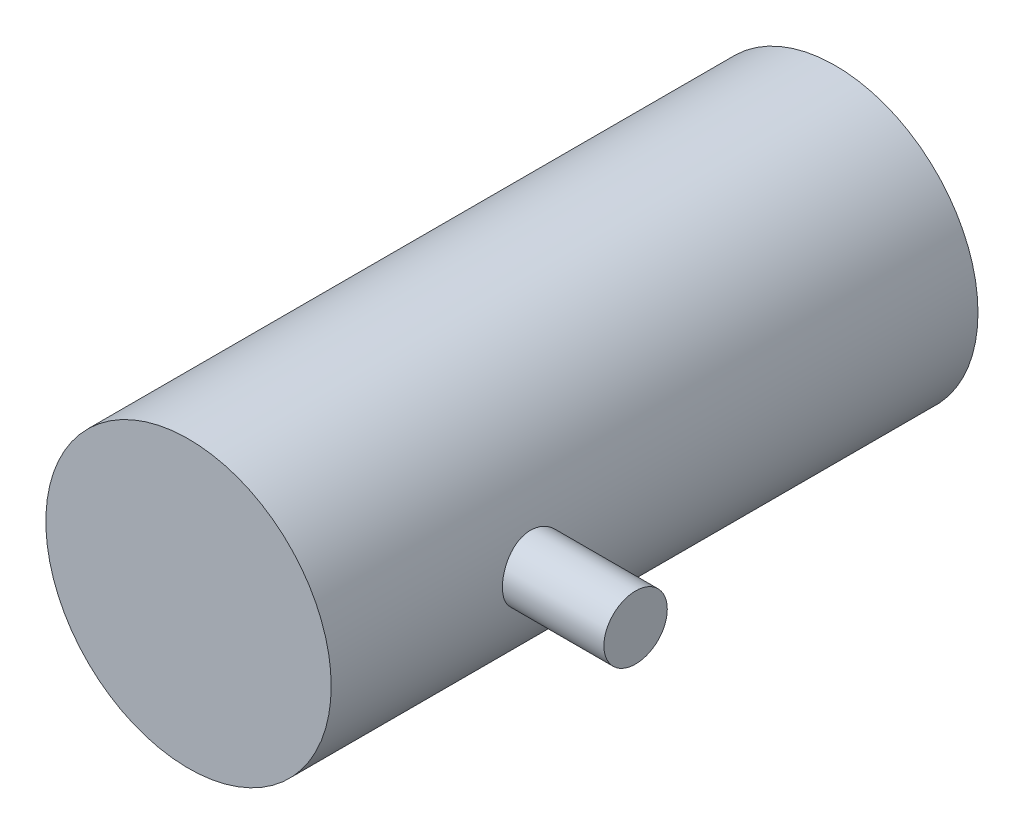
ISO-10303-21;
HEADER;
FILE_DESCRIPTION(('STEP AP214'),'2;1');
FILE_NAME('part.step','',(''),(''),'','','');
FILE_SCHEMA(('AUTOMOTIVE_DESIGN { 1 0 10303 214 1 1 1 1 }'));
ENDSEC;
DATA;
#1=APPLICATION_CONTEXT('core data for automotive mechanical design processes');
#2=APPLICATION_PROTOCOL_DEFINITION('international standard','automotive_design',2000,#1);
#3=PRODUCT_CONTEXT('',#1,'mechanical');
#4=PRODUCT('Part','Part','',(#3));
#5=PRODUCT_RELATED_PRODUCT_CATEGORY('part','',(#4));
#6=PRODUCT_DEFINITION_FORMATION('','',#4);
#7=PRODUCT_DEFINITION_CONTEXT('part definition',#1,'design');
#8=PRODUCT_DEFINITION('design','',#6,#7);
#9=PRODUCT_DEFINITION_SHAPE('','',#8);
#10=(LENGTH_UNIT() NAMED_UNIT(*) SI_UNIT(.MILLI.,.METRE.));
#11=(NAMED_UNIT(*) PLANE_ANGLE_UNIT() SI_UNIT($,.RADIAN.));
#12=(NAMED_UNIT(*) SI_UNIT($,.STERADIAN.) SOLID_ANGLE_UNIT());
#13=UNCERTAINTY_MEASURE_WITH_UNIT(LENGTH_MEASURE(1.E-05),#10,'distance_accuracy_value','');
#14=(GEOMETRIC_REPRESENTATION_CONTEXT(3) GLOBAL_UNCERTAINTY_ASSIGNED_CONTEXT((#13)) GLOBAL_UNIT_ASSIGNED_CONTEXT((#10,
#11,#12)) REPRESENTATION_CONTEXT('',''));
#15=CARTESIAN_POINT('',(0.,0.,0.));
#16=DIRECTION('',(0.,0.,1.));
#17=DIRECTION('',(1.,0.,0.));
#18=AXIS2_PLACEMENT_3D('',#15,#16,#17);
#19=CARTESIAN_POINT('',(0.,0.,1020.));
#20=DIRECTION('',(0.,0.,-1.));
#21=DIRECTION('',(-1.,0.,0.));
#22=AXIS2_PLACEMENT_3D('',#19,#20,#21);
#23=CYLINDRICAL_SURFACE('',#22,225.);
#24=CARTESIAN_POINT('',(0.,0.,1020.));
#25=DIRECTION('',(0.,0.,1.));
#26=DIRECTION('',(1.,0.,0.));
#27=AXIS2_PLACEMENT_3D('',#24,#25,#26);
#28=CIRCLE('',#27,225.);
#29=CARTESIAN_POINT('',(225.,0.,1020.));
#30=VERTEX_POINT('',#29);
#31=EDGE_CURVE('E53',#30,#30,#28,.T.);
#32=ORIENTED_EDGE('',*,*,#31,.F.);
#33=EDGE_LOOP('',(#32));
#34=FACE_BOUND('',#33,.T.);
#35=CARTESIAN_POINT('',(0.,0.,0.));
#36=DIRECTION('',(0.,0.,1.));
#37=DIRECTION('',(1.,0.,0.));
#38=AXIS2_PLACEMENT_3D('',#35,#36,#37);
#39=CIRCLE('',#38,225.);
#40=CARTESIAN_POINT('',(225.,0.,0.));
#41=VERTEX_POINT('',#40);
#42=EDGE_CURVE('E58',#41,#41,#39,.T.);
#43=ORIENTED_EDGE('',*,*,#42,.T.);
#44=EDGE_LOOP('',(#43));
#45=FACE_BOUND('',#44,.T.);
#46=CARTESIAN_POINT('',(225.,0.,750.));
#47=CARTESIAN_POINT('',(224.999996456118,-1.38615094831465,749.999993041177));
#48=CARTESIAN_POINT('',(224.987158057542,-2.77245161847841,749.942308563174));
#49=CARTESIAN_POINT('',(224.936151206443,-5.53512210582347,749.712015070931));
#50=CARTESIAN_POINT('',(224.897979052791,-6.91149044223729,749.539389264347));
#51=CARTESIAN_POINT('',(224.797337434917,-9.64514965598729,749.080475211776));
#52=CARTESIAN_POINT('',(224.734852639126,-11.0024279344115,748.794115242567));
#53=CARTESIAN_POINT('',(224.58732258685,-13.6873037406297,748.110049527636));
#54=CARTESIAN_POINT('',(224.502278102278,-15.0149022822732,747.712347591612));
#55=CARTESIAN_POINT('',(224.312072747885,-17.6298288780287,746.809192438183));
#56=CARTESIAN_POINT('',(224.206933462056,-18.9171984316892,746.303854767161));
#57=CARTESIAN_POINT('',(223.97934573799,-21.444406303863,745.188991200007));
#58=CARTESIAN_POINT('',(223.856897169847,-22.6842442655594,744.579464521921));
#59=CARTESIAN_POINT('',(223.59800988827,-25.108078861729,743.260696282283));
#60=CARTESIAN_POINT('',(223.461571835784,-26.2920781304969,742.551459431043));
#61=CARTESIAN_POINT('',(223.178367574299,-28.5965775623553,741.038225795263));
#62=CARTESIAN_POINT('',(223.031601257718,-29.7170770637856,740.234228023596));
#63=CARTESIAN_POINT('',(222.729446544333,-31.9034433150076,738.524339030176));
#64=CARTESIAN_POINT('',(222.573962583707,-32.9682539138473,737.617113979959));
#65=CARTESIAN_POINT('',(222.260693997389,-35.0179822255174,735.71685969939));
#66=CARTESIAN_POINT('',(222.102909349336,-36.0028991611699,734.723829634549));
#67=CARTESIAN_POINT('',(221.789396175815,-37.8863496888281,732.658504136207));
#68=CARTESIAN_POINT('',(221.633667832734,-38.7848756621024,731.586201726481));
#69=CARTESIAN_POINT('',(221.328631392511,-40.489341237855,729.369507890408));
#70=CARTESIAN_POINT('',(221.179323321405,-41.2952804648999,728.225116171773));
#71=CARTESIAN_POINT('',(220.889696066711,-42.817632822677,725.858320056559));
#72=CARTESIAN_POINT('',(220.74949968735,-43.5329125492812,724.63517116755));
#73=CARTESIAN_POINT('',(220.484113078375,-44.8576919613043,722.131280849393));
#74=CARTESIAN_POINT('',(220.358922995631,-45.4671906114416,720.850538856734));
#75=CARTESIAN_POINT('',(220.127302493108,-46.575653513666,718.240570687357));
#76=CARTESIAN_POINT('',(220.020870269355,-47.0746283961862,716.911349187846));
#77=CARTESIAN_POINT('',(219.829989123263,-47.9581106553375,714.213857773215));
#78=CARTESIAN_POINT('',(219.745539791495,-48.3426201638946,712.845588585883));
#79=CARTESIAN_POINT('',(219.602388428414,-48.9887622084792,710.102233168369));
#80=CARTESIAN_POINT('',(219.543295278102,-49.2522660900667,708.727608004967));
#81=CARTESIAN_POINT('',(219.45070626864,-49.6631857162476,705.960257529352));
#82=CARTESIAN_POINT('',(219.417210162013,-49.8106025831897,704.567532392264));
#83=CARTESIAN_POINT('',(219.37684180316,-49.9880946025793,701.774394763089));
#84=CARTESIAN_POINT('',(219.369966590258,-50.0181828038844,700.373983143212));
#85=CARTESIAN_POINT('',(219.38304340326,-49.9607960953549,697.575705108165));
#86=CARTESIAN_POINT('',(219.402995144561,-49.8733224327162,696.177838666151));
#87=CARTESIAN_POINT('',(219.468487067225,-49.5843173772611,693.421268272471));
#88=CARTESIAN_POINT('',(219.513537298211,-49.3849693662355,692.062323068516));
#89=CARTESIAN_POINT('',(219.627546678266,-48.8754416039227,689.366418601035));
#90=CARTESIAN_POINT('',(219.696505481203,-48.5652634571617,688.029459019508));
#91=CARTESIAN_POINT('',(219.85633483982,-47.8365029462968,685.386721948989));
#92=CARTESIAN_POINT('',(219.947206264225,-47.4179162842957,684.080945698513));
#93=CARTESIAN_POINT('',(220.148260500803,-46.4755346742675,681.509464546687));
#94=CARTESIAN_POINT('',(220.258443557015,-45.9517383967057,680.243760151959));
#95=CARTESIAN_POINT('',(220.495987930718,-44.7980888404603,677.750657103474));
#96=CARTESIAN_POINT('',(220.6234823425,-44.1674033890726,676.52365628522));
#97=CARTESIAN_POINT('',(220.891362422272,-42.8075461789845,674.126995718739));
#98=CARTESIAN_POINT('',(221.031748130577,-42.0783741122786,672.957336149854));
#99=CARTESIAN_POINT('',(221.321543783108,-40.5264994308493,670.68279455513));
#100=CARTESIAN_POINT('',(221.470954788546,-39.703785807231,669.577920177093));
#101=CARTESIAN_POINT('',(221.774710360705,-37.9704076317874,667.44018025168));
#102=CARTESIAN_POINT('',(221.929055002261,-37.0597417454395,666.407315797338));
#103=CARTESIAN_POINT('',(222.241974592459,-35.1351120931606,664.398002162333));
#104=CARTESIAN_POINT('',(222.400566948822,-34.1192935567696,663.423331377627));
#105=CARTESIAN_POINT('',(222.714112151477,-32.0087825489535,661.562819563969));
#106=CARTESIAN_POINT('',(222.86906494151,-30.9140888593677,660.676979907444));
#107=CARTESIAN_POINT('',(223.17100571721,-28.6531451434848,659.000267193713));
#108=CARTESIAN_POINT('',(223.317993490463,-27.4868932105996,658.209396668512));
#109=CARTESIAN_POINT('',(223.599887786289,-25.0907388691152,656.728316712267));
#110=CARTESIAN_POINT('',(223.734794372199,-23.8608367942553,656.038106753496));
#111=CARTESIAN_POINT('',(223.989026137199,-21.3429302561997,654.762008411756));
#112=CARTESIAN_POINT('',(224.108315106052,-20.0547997671097,654.17636135936));
#113=CARTESIAN_POINT('',(224.327558506509,-17.4320947074024,653.11585718376));
#114=CARTESIAN_POINT('',(224.427512858827,-16.0975199463583,652.641000514871));
#115=CARTESIAN_POINT('',(224.605210309568,-13.3916903788066,651.805943675972));
#116=CARTESIAN_POINT('',(224.682956125164,-12.020440081953,651.445729479053));
#117=CARTESIAN_POINT('',(224.814004627413,-9.25119065500389,650.842870337578));
#118=CARTESIAN_POINT('',(224.867307783626,-7.8531920392994,650.600223134474));
#119=CARTESIAN_POINT('',(224.947097521661,-5.06971805984365,650.238296263729));
#120=CARTESIAN_POINT('',(224.974111008766,-3.68457268981837,650.116591531801));
#121=CARTESIAN_POINT('',(225.00244595311,-0.90870334574698,649.988955092333));
#122=CARTESIAN_POINT('',(225.003767760671,0.482020551973866,649.983021806179));
#123=CARTESIAN_POINT('',(224.980683191125,3.25882181838291,650.086972197799));
#124=CARTESIAN_POINT('',(224.956278491713,4.64489948415155,650.196848323328));
#125=CARTESIAN_POINT('',(224.882427923838,7.40243260161623,650.531495149669));
#126=CARTESIAN_POINT('',(224.832982123201,8.77388809290765,650.756265539278));
#127=CARTESIAN_POINT('',(224.711130134589,11.4768247099771,651.315654324981));
#128=CARTESIAN_POINT('',(224.638991847124,12.8085832100074,651.6489925499));
#129=CARTESIAN_POINT('',(224.47355048208,15.4389710664213,652.423557377661));
#130=CARTESIAN_POINT('',(224.38024761575,16.7376007533273,652.864782903658));
#131=CARTESIAN_POINT('',(224.174980645158,19.2930417753973,653.851816649086));
#132=CARTESIAN_POINT('',(224.063015335009,20.5498504019685,654.397631626971));
#133=CARTESIAN_POINT('',(223.823415673047,23.01326379891,655.589841016424));
#134=CARTESIAN_POINT('',(223.695781083178,24.2198678061784,656.236236956099));
#135=CARTESIAN_POINT('',(223.426263636533,26.592310180166,657.63523717085));
#136=CARTESIAN_POINT('',(223.284199399648,27.7572921032473,658.389258968009));
#137=CARTESIAN_POINT('',(222.991276641644,30.01986154881,659.990887345111));
#138=CARTESIAN_POINT('',(222.840418048524,31.1174485193657,660.838494691308));
#139=CARTESIAN_POINT('',(222.533974366516,33.2382084395758,662.62165021729));
#140=CARTESIAN_POINT('',(222.378388724047,34.2613726256391,663.55720872405));
#141=CARTESIAN_POINT('',(222.066728624552,36.226482108378,665.509989731127));
#142=CARTESIAN_POINT('',(221.910654162135,37.1684265060315,666.527213135153));
#143=CARTESIAN_POINT('',(221.599330404578,38.9820423138289,668.656841333461));
#144=CARTESIAN_POINT('',(221.444153756609,39.8520286784367,669.770692575269));
#145=CARTESIAN_POINT('',(221.142158818574,41.495103545966,672.068804685619));
#146=CARTESIAN_POINT('',(220.995340648049,42.2681906632449,673.253066560662));
#147=CARTESIAN_POINT('',(220.714329012239,43.7118519547107,675.683910894463));
#148=CARTESIAN_POINT('',(220.580135215732,44.3824288187257,676.930491716855));
#149=CARTESIAN_POINT('',(220.328328394571,45.6160529286624,679.477384187539));
#150=CARTESIAN_POINT('',(220.210715175774,46.1791014336637,680.777695206471));
#151=CARTESIAN_POINT('',(219.996218078376,47.1903578201814,683.415264348679));
#152=CARTESIAN_POINT('',(219.899218754046,47.6392082058668,684.752266657863));
#153=CARTESIAN_POINT('',(219.728026597357,48.4226736453448,687.46077857548));
#154=CARTESIAN_POINT('',(219.653833724135,48.7572889038195,688.83228812208));
#155=CARTESIAN_POINT('',(219.53053671856,49.3094677408954,691.599593899223));
#156=CARTESIAN_POINT('',(219.481429091707,49.527047623331,692.995386718958));
#157=CARTESIAN_POINT('',(219.409810255717,49.8433706317294,695.801043500933));
#158=CARTESIAN_POINT('',(219.387298564397,49.9421159121565,697.2109072076));
#159=CARTESIAN_POINT('',(219.369770463354,50.0190484690492,700.002226082133));
#160=CARTESIAN_POINT('',(219.374145199334,49.9999053568955,701.383604567295));
#161=CARTESIAN_POINT('',(219.408838638468,49.8474436037207,704.139701104009));
#162=CARTESIAN_POINT('',(219.439156928657,49.7141267800987,705.514419261228));
#163=CARTESIAN_POINT('',(219.524834152762,49.3344195690336,708.247319950179));
#164=CARTESIAN_POINT('',(219.580192617204,49.0880313015567,709.60550279144));
#165=CARTESIAN_POINT('',(219.714315974784,48.4841713024202,712.295759250023));
#166=CARTESIAN_POINT('',(219.793080976078,48.1266990574704,713.62783274667));
#167=CARTESIAN_POINT('',(219.971386789455,47.3050194375939,716.251710942265));
#168=CARTESIAN_POINT('',(220.0708490073,46.8412151818076,717.543647317374));
#169=CARTESIAN_POINT('',(220.287889832044,45.8096408739373,720.08372134079));
#170=CARTESIAN_POINT('',(220.405468349345,45.2418713360264,721.331859205671));
#171=CARTESIAN_POINT('',(220.655457348097,44.006432977723,723.776235158173));
#172=CARTESIAN_POINT('',(220.787869051374,43.3387559263078,724.97246895912));
#173=CARTESIAN_POINT('',(221.063868119405,41.9081933397862,727.305228396701));
#174=CARTESIAN_POINT('',(221.20745567286,41.1453061969493,728.441753024618));
#175=CARTESIAN_POINT('',(221.50498111056,39.5126047623578,730.670870079982));
#176=CARTESIAN_POINT('',(221.65907237728,38.6408927040773,731.76205247293));
#177=CARTESIAN_POINT('',(221.970539489976,36.8095378746553,733.867457090115));
#178=CARTESIAN_POINT('',(222.12791538622,35.8498937570518,734.881678135444));
#179=CARTESIAN_POINT('',(222.441634188559,33.8488550905784,736.82665059396));
#180=CARTESIAN_POINT('',(222.597976850424,32.8074419136372,737.757382883236));
#181=CARTESIAN_POINT('',(222.905288619525,30.6499489531873,739.528835450792));
#182=CARTESIAN_POINT('',(223.05625775265,29.5338695294737,740.369556162762));
#183=CARTESIAN_POINT('',(223.350649049084,27.2188731042804,741.965895238598));
#184=CARTESIAN_POINT('',(223.49394179627,26.0190411197887,742.720211333343));
#185=CARTESIAN_POINT('',(223.76669420905,23.5584081902699,744.124918178367));
#186=CARTESIAN_POINT('',(223.896153173073,22.2976041577937,744.775303658706));
#187=CARTESIAN_POINT('',(224.137452232176,19.7248711206427,745.966701897721));
#188=CARTESIAN_POINT('',(224.249305389176,18.4129809273222,746.507795826099));
#189=CARTESIAN_POINT('',(224.452287029264,15.7466584376511,747.476878662289));
#190=CARTESIAN_POINT('',(224.543419148643,14.3922336531588,747.904887417316));
#191=CARTESIAN_POINT('',(224.684261939779,11.9627930787615,748.560217968262));
#192=CARTESIAN_POINT('',(224.738679332896,10.8943206132592,748.811044076357));
#193=CARTESIAN_POINT('',(224.832676105614,8.7422872673527,749.242021306087));
#194=CARTESIAN_POINT('',(224.872252460785,7.65872335809966,749.422158022397));
#195=CARTESIAN_POINT('',(224.935850979507,5.48167540028845,749.710732182985));
#196=CARTESIAN_POINT('',(224.959873717002,4.38819171929016,749.819172272945));
#197=CARTESIAN_POINT('',(224.991947926088,2.19650265158576,749.963801224579));
#198=CARTESIAN_POINT('',(225.000002807948,1.09829832329485,750.000005513731));
#199=CARTESIAN_POINT('',(225.,0.,750.));
#200=B_SPLINE_CURVE_WITH_KNOTS('',3,(#46,#47,#48,#49,#50,#51,#52,#53,#54,#55,#56,#57,#58,#59,
#60,#61,#62,#63,#64,#65,#66,#67,#68,#69,#70,#71,#72,#73,#74,#75,#76,#77,#78,#79,#80,#81,#82,#83,
#84,#85,#86,#87,#88,#89,#90,#91,#92,#93,#94,#95,#96,#97,#98,#99,#100,#101,#102,#103,#104,#105,
#106,#107,#108,#109,#110,#111,#112,#113,#114,#115,#116,#117,#118,#119,#120,#121,#122,#123,#124,
#125,#126,#127,#128,#129,#130,#131,#132,#133,#134,#135,#136,#137,#138,#139,#140,#141,#142,#143,
#144,#145,#146,#147,#148,#149,#150,#151,#152,#153,#154,#155,#156,#157,#158,#159,#160,#161,#162,
#163,#164,#165,#166,#167,#168,#169,#170,#171,#172,#173,#174,#175,#176,#177,#178,#179,#180,#181,
#182,#183,#184,#185,#186,#187,#188,#189,#190,#191,#192,#193,#194,#195,#196,#197,#198,#199),
.UNSPECIFIED.,.T.,.F.,(4,2,2,2,2,2,2,2,2,2,2,2,2,2,2,2,2,2,2,2,2,2,2,2,2,2,2,2,2,2,2,2,2,2,2,2,
2,2,2,2,2,2,2,2,2,2,2,2,2,2,2,2,2,2,2,2,2,2,2,2,2,2,2,2,2,2,2,2,2,2,2,2,2,2,2,2,4),(0.,
4.15745682817915,8.31552117301605,12.4762118571432,16.6367601956517,20.7928645174114,
24.9490000326782,29.1049392779348,33.2609218196369,37.4785147366287,41.6961486759851,
45.9141542236893,50.1321768745305,54.3986001490677,58.6650651768279,62.9311196676965,
67.1970946980194,71.3946694934709,75.592203705564,79.7892710702046,83.9862939091545,
88.1041201762474,92.2218868305554,96.3398167602961,100.457798731623,104.6094520632,
108.761118378895,112.91327381046,117.065492253663,121.310576541675,125.55572640552,
129.800989425723,134.046230188822,138.301145731646,142.556078722161,146.810490906345,
151.064821356955,155.232012964091,159.399147748982,163.566010800489,167.732862565678,
171.852259599638,175.971615518745,180.091237715806,184.210922507587,188.390974895019,
192.571061510093,196.751639553488,200.932263865779,205.19270665333,209.453210357539,
213.713602248635,217.973944250553,222.209758368821,226.445564897483,230.680781196188,
234.915920709517,239.055512572637,243.195038543612,247.334486906166,251.473954396317,
255.597980778633,259.721986765616,263.846332701964,267.97074829201,272.181156831208,
276.391629853172,280.60306487517,284.814479604942,289.082754921274,293.351246597577,
297.616556357332,301.881117028257,305.175377194807,308.470308328769,311.765117869438,
315.059223658647),.UNSPECIFIED.);
#201=CARTESIAN_POINT('',(225.,0.,750.));
#202=VERTEX_POINT('',#201);
#203=EDGE_CURVE('E10',#202,#202,#200,.T.);
#204=ORIENTED_EDGE('',*,*,#203,.F.);
#205=EDGE_LOOP('',(#204));
#206=FACE_BOUND('',#205,.T.);
#207=ADVANCED_FACE('F41',(#34,#45,#206),#23,.T.);
#208=CARTESIAN_POINT('',(0.,0.,1020.));
#209=DIRECTION('',(0.,0.,1.));
#210=DIRECTION('',(1.,0.,0.));
#211=AXIS2_PLACEMENT_3D('',#208,#209,#210);
#212=PLANE('',#211);
#213=ORIENTED_EDGE('',*,*,#31,.T.);
#214=EDGE_LOOP('',(#213));
#215=FACE_BOUND('',#214,.T.);
#216=ADVANCED_FACE('F81',(#215),#212,.T.);
#217=CARTESIAN_POINT('',(0.,0.,0.));
#218=DIRECTION('',(0.,0.,1.));
#219=DIRECTION('',(1.,0.,0.));
#220=AXIS2_PLACEMENT_3D('',#217,#218,#219);
#221=PLANE('',#220);
#222=ORIENTED_EDGE('',*,*,#42,.F.);
#223=EDGE_LOOP('',(#222));
#224=FACE_BOUND('',#223,.T.);
#225=ADVANCED_FACE('F74',(#224),#221,.F.);
#226=CARTESIAN_POINT('',(385.,0.,700.));
#227=DIRECTION('',(-1.,0.,0.));
#228=DIRECTION('',(0.,0.,1.));
#229=AXIS2_PLACEMENT_3D('',#226,#227,#228);
#230=CYLINDRICAL_SURFACE('',#229,50.);
#231=CARTESIAN_POINT('',(385.,0.,700.));
#232=DIRECTION('',(1.,0.,0.));
#233=DIRECTION('',(0.,0.,-1.));
#234=AXIS2_PLACEMENT_3D('',#231,#232,#233);
#235=CIRCLE('',#234,50.);
#236=CARTESIAN_POINT('',(385.,0.,650.));
#237=VERTEX_POINT('',#236);
#238=EDGE_CURVE('E64',#237,#237,#235,.T.);
#239=ORIENTED_EDGE('',*,*,#238,.F.);
#240=EDGE_LOOP('',(#239));
#241=FACE_BOUND('',#240,.T.);
#242=ORIENTED_EDGE('',*,*,#203,.T.);
#243=EDGE_LOOP('',(#242));
#244=FACE_BOUND('',#243,.T.);
#245=ADVANCED_FACE('F72',(#241,#244),#230,.T.);
#246=CARTESIAN_POINT('',(385.,0.,700.));
#247=DIRECTION('',(1.,0.,0.));
#248=DIRECTION('',(0.,0.,-1.));
#249=AXIS2_PLACEMENT_3D('',#246,#247,#248);
#250=PLANE('',#249);
#251=ORIENTED_EDGE('',*,*,#238,.T.);
#252=EDGE_LOOP('',(#251));
#253=FACE_BOUND('',#252,.T.);
#254=ADVANCED_FACE('F70',(#253),#250,.T.);
#255=CLOSED_SHELL('',(#207,#216,#225,#245,#254));
#256=MANIFOLD_SOLID_BREP('B2',#255);
#257=ADVANCED_BREP_SHAPE_REPRESENTATION('',(#18,#256),#14);
#258=SHAPE_DEFINITION_REPRESENTATION(#9,#257);
ENDSEC;
END-ISO-10303-21;
